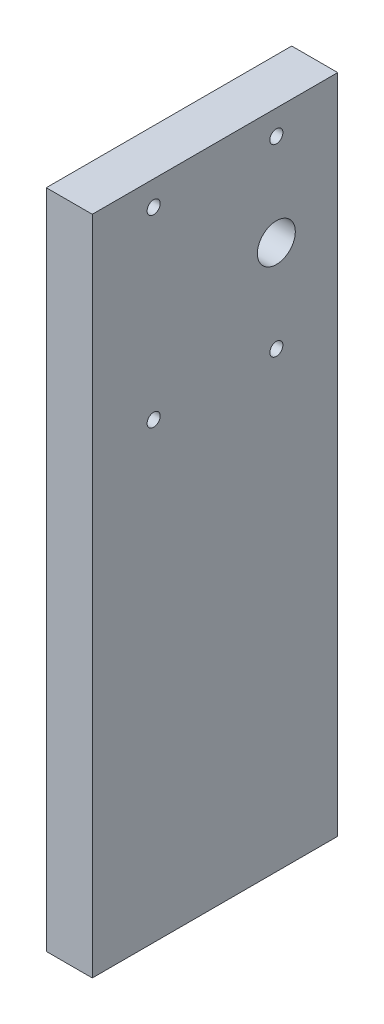
ISO-10303-21;
HEADER;
FILE_DESCRIPTION(('STEP AP214'),'2;1');
FILE_NAME('part.step','',(''),(''),'','','');
FILE_SCHEMA(('AUTOMOTIVE_DESIGN { 1 0 10303 214 1 1 1 1 }'));
ENDSEC;
DATA;
#1=APPLICATION_CONTEXT('core data for automotive mechanical design processes');
#2=APPLICATION_PROTOCOL_DEFINITION('international standard','automotive_design',2000,#1);
#3=PRODUCT_CONTEXT('',#1,'mechanical');
#4=PRODUCT('Part','Part','',(#3));
#5=PRODUCT_RELATED_PRODUCT_CATEGORY('part','',(#4));
#6=PRODUCT_DEFINITION_FORMATION('','',#4);
#7=PRODUCT_DEFINITION_CONTEXT('part definition',#1,'design');
#8=PRODUCT_DEFINITION('design','',#6,#7);
#9=PRODUCT_DEFINITION_SHAPE('','',#8);
#10=(LENGTH_UNIT() NAMED_UNIT(*) SI_UNIT(.MILLI.,.METRE.));
#11=(NAMED_UNIT(*) PLANE_ANGLE_UNIT() SI_UNIT($,.RADIAN.));
#12=(NAMED_UNIT(*) SI_UNIT($,.STERADIAN.) SOLID_ANGLE_UNIT());
#13=UNCERTAINTY_MEASURE_WITH_UNIT(LENGTH_MEASURE(1.E-05),#10,'distance_accuracy_value','');
#14=(GEOMETRIC_REPRESENTATION_CONTEXT(3) GLOBAL_UNCERTAINTY_ASSIGNED_CONTEXT((#13)) GLOBAL_UNIT_ASSIGNED_CONTEXT((#10,
#11,#12)) REPRESENTATION_CONTEXT('',''));
#15=CARTESIAN_POINT('',(0.,0.,0.));
#16=DIRECTION('',(0.,0.,1.));
#17=DIRECTION('',(1.,0.,0.));
#18=AXIS2_PLACEMENT_3D('',#15,#16,#17);
#19=CARTESIAN_POINT('',(4.7625,0.,0.));
#20=DIRECTION('',(1.,0.,0.));
#21=DIRECTION('',(0.,0.,-1.));
#22=AXIS2_PLACEMENT_3D('',#19,#20,#21);
#23=PLANE('',#22);
#24=CARTESIAN_POINT('',(4.7625,-96.774,25.4));
#25=DIRECTION('',(1.,0.,0.));
#26=DIRECTION('',(0.,0.,-1.));
#27=AXIS2_PLACEMENT_3D('',#24,#25,#26);
#28=CIRCLE('',#27,1.35254999999999);
#29=CARTESIAN_POINT('',(4.7625,-96.774,24.04745));
#30=VERTEX_POINT('',#29);
#31=EDGE_CURVE('E138',#30,#30,#28,.T.);
#32=ORIENTED_EDGE('',*,*,#31,.F.);
#33=EDGE_LOOP('',(#32));
#34=FACE_BOUND('',#33,.T.);
#35=CARTESIAN_POINT('',(4.7625,-96.774,0.));
#36=DIRECTION('',(1.,0.,0.));
#37=DIRECTION('',(0.,0.,-1.));
#38=AXIS2_PLACEMENT_3D('',#35,#36,#37);
#39=CIRCLE('',#38,1.35254999999998);
#40=CARTESIAN_POINT('',(4.7625,-96.774,-1.35254999999997));
#41=VERTEX_POINT('',#40);
#42=EDGE_CURVE('E132',#41,#41,#39,.T.);
#43=ORIENTED_EDGE('',*,*,#42,.F.);
#44=EDGE_LOOP('',(#43));
#45=FACE_BOUND('',#44,.T.);
#46=CARTESIAN_POINT('',(4.7625,-134.874,0.));
#47=DIRECTION('',(1.,0.,0.));
#48=DIRECTION('',(0.,0.,-1.));
#49=AXIS2_PLACEMENT_3D('',#46,#47,#48);
#50=CIRCLE('',#49,1.35254999999998);
#51=CARTESIAN_POINT('',(4.7625,-134.874,-1.35254999999998));
#52=VERTEX_POINT('',#51);
#53=EDGE_CURVE('E126',#52,#52,#50,.T.);
#54=ORIENTED_EDGE('',*,*,#53,.F.);
#55=EDGE_LOOP('',(#54));
#56=FACE_BOUND('',#55,.T.);
#57=CARTESIAN_POINT('',(4.7625,-134.874,25.4));
#58=DIRECTION('',(1.,0.,0.));
#59=DIRECTION('',(0.,0.,-1.));
#60=AXIS2_PLACEMENT_3D('',#57,#58,#59);
#61=CIRCLE('',#60,1.35254999999998);
#62=CARTESIAN_POINT('',(4.7625,-134.874,24.04745));
#63=VERTEX_POINT('',#62);
#64=EDGE_CURVE('E120',#63,#63,#61,.T.);
#65=ORIENTED_EDGE('',*,*,#64,.F.);
#66=EDGE_LOOP('',(#65));
#67=FACE_BOUND('',#66,.T.);
#68=DIRECTION('',(0.,-1.,0.));
#69=VECTOR('',#68,1.);
#70=CARTESIAN_POINT('',(4.7625,-91.694,38.1));
#71=LINE('',#70,#69);
#72=CARTESIAN_POINT('',(4.7625,-91.694,38.1));
#73=VERTEX_POINT('',#72);
#74=CARTESIAN_POINT('',(4.7625,-228.6,38.1));
#75=VERTEX_POINT('',#74);
#76=EDGE_CURVE('E85',#73,#75,#71,.T.);
#77=ORIENTED_EDGE('',*,*,#76,.T.);
#78=DIRECTION('',(0.,0.,-1.));
#79=VECTOR('',#78,1.);
#80=CARTESIAN_POINT('',(4.7625,-228.6,38.1));
#81=LINE('',#80,#79);
#82=CARTESIAN_POINT('',(4.7625,-228.6,-12.7));
#83=VERTEX_POINT('',#82);
#84=EDGE_CURVE('E80',#75,#83,#81,.T.);
#85=ORIENTED_EDGE('',*,*,#84,.T.);
#86=DIRECTION('',(0.,1.,0.));
#87=VECTOR('',#86,1.);
#88=CARTESIAN_POINT('',(4.7625,-91.694,-12.7));
#89=LINE('',#88,#87);
#90=CARTESIAN_POINT('',(4.7625,-91.694,-12.7));
#91=VERTEX_POINT('',#90);
#92=EDGE_CURVE('E83',#83,#91,#89,.T.);
#93=ORIENTED_EDGE('',*,*,#92,.T.);
#94=DIRECTION('',(0.,0.,1.));
#95=VECTOR('',#94,1.);
#96=CARTESIAN_POINT('',(4.7625,-91.694,38.1));
#97=LINE('',#96,#95);
#98=EDGE_CURVE('E50',#91,#73,#97,.T.);
#99=ORIENTED_EDGE('',*,*,#98,.T.);
#100=EDGE_LOOP('',(#77,#85,#93,#99));
#101=FACE_BOUND('',#100,.T.);
#102=CARTESIAN_POINT('',(4.7625,-115.824,0.));
#103=DIRECTION('',(1.,0.,0.));
#104=DIRECTION('',(0.,0.,-1.));
#105=AXIS2_PLACEMENT_3D('',#102,#103,#104);
#106=CIRCLE('',#105,3.925);
#107=CARTESIAN_POINT('',(4.7625,-115.824,-3.925));
#108=VERTEX_POINT('',#107);
#109=EDGE_CURVE('E100',#108,#108,#106,.T.);
#110=ORIENTED_EDGE('',*,*,#109,.F.);
#111=EDGE_LOOP('',(#110));
#112=FACE_BOUND('',#111,.T.);
#113=ADVANCED_FACE('F33',(#34,#45,#56,#67,#101,#112),#23,.T.);
#114=CARTESIAN_POINT('',(-4.7625,0.,0.));
#115=DIRECTION('',(1.,0.,0.));
#116=DIRECTION('',(0.,0.,-1.));
#117=AXIS2_PLACEMENT_3D('',#114,#115,#116);
#118=PLANE('',#117);
#119=CARTESIAN_POINT('',(-4.7625,-96.774,25.4));
#120=DIRECTION('',(1.,0.,0.));
#121=DIRECTION('',(0.,0.,-1.));
#122=AXIS2_PLACEMENT_3D('',#119,#120,#121);
#123=CIRCLE('',#122,1.35254999999999);
#124=CARTESIAN_POINT('',(-4.7625,-96.774,24.04745));
#125=VERTEX_POINT('',#124);
#126=EDGE_CURVE('E135',#125,#125,#123,.T.);
#127=ORIENTED_EDGE('',*,*,#126,.T.);
#128=EDGE_LOOP('',(#127));
#129=FACE_BOUND('',#128,.T.);
#130=CARTESIAN_POINT('',(-4.7625,-96.774,0.));
#131=DIRECTION('',(1.,0.,0.));
#132=DIRECTION('',(0.,0.,-1.));
#133=AXIS2_PLACEMENT_3D('',#130,#131,#132);
#134=CIRCLE('',#133,1.35254999999999);
#135=CARTESIAN_POINT('',(-4.7625,-96.774,-1.35254999999999));
#136=VERTEX_POINT('',#135);
#137=EDGE_CURVE('E129',#136,#136,#134,.T.);
#138=ORIENTED_EDGE('',*,*,#137,.T.);
#139=EDGE_LOOP('',(#138));
#140=FACE_BOUND('',#139,.T.);
#141=CARTESIAN_POINT('',(-4.7625,-134.874,0.));
#142=DIRECTION('',(1.,0.,0.));
#143=DIRECTION('',(0.,0.,-1.));
#144=AXIS2_PLACEMENT_3D('',#141,#142,#143);
#145=CIRCLE('',#144,1.35255000000001);
#146=CARTESIAN_POINT('',(-4.7625,-134.874,-1.35255000000001));
#147=VERTEX_POINT('',#146);
#148=EDGE_CURVE('E123',#147,#147,#145,.T.);
#149=ORIENTED_EDGE('',*,*,#148,.T.);
#150=EDGE_LOOP('',(#149));
#151=FACE_BOUND('',#150,.T.);
#152=CARTESIAN_POINT('',(-4.7625,-134.874,25.4));
#153=DIRECTION('',(1.,0.,0.));
#154=DIRECTION('',(0.,0.,-1.));
#155=AXIS2_PLACEMENT_3D('',#152,#153,#154);
#156=CIRCLE('',#155,1.35255000000001);
#157=CARTESIAN_POINT('',(-4.7625,-134.874,24.04745));
#158=VERTEX_POINT('',#157);
#159=EDGE_CURVE('E115',#158,#158,#156,.T.);
#160=ORIENTED_EDGE('',*,*,#159,.T.);
#161=EDGE_LOOP('',(#160));
#162=FACE_BOUND('',#161,.T.);
#163=DIRECTION('',(0.,-1.,0.));
#164=VECTOR('',#163,1.);
#165=CARTESIAN_POINT('',(-4.7625,-91.694,38.1));
#166=LINE('',#165,#164);
#167=CARTESIAN_POINT('',(-4.7625,-91.694,38.1));
#168=VERTEX_POINT('',#167);
#169=CARTESIAN_POINT('',(-4.7625,-228.6,38.1));
#170=VERTEX_POINT('',#169);
#171=EDGE_CURVE('E97',#168,#170,#166,.T.);
#172=ORIENTED_EDGE('',*,*,#171,.F.);
#173=DIRECTION('',(0.,0.,1.));
#174=VECTOR('',#173,1.);
#175=CARTESIAN_POINT('',(-4.7625,-91.694,38.1));
#176=LINE('',#175,#174);
#177=CARTESIAN_POINT('',(-4.7625,-91.694,-12.7));
#178=VERTEX_POINT('',#177);
#179=EDGE_CURVE('E73',#178,#168,#176,.T.);
#180=ORIENTED_EDGE('',*,*,#179,.F.);
#181=DIRECTION('',(0.,1.,0.));
#182=VECTOR('',#181,1.);
#183=CARTESIAN_POINT('',(-4.7625,-91.694,-12.7));
#184=LINE('',#183,#182);
#185=CARTESIAN_POINT('',(-4.7625,-228.6,-12.7));
#186=VERTEX_POINT('',#185);
#187=EDGE_CURVE('E67',#186,#178,#184,.T.);
#188=ORIENTED_EDGE('',*,*,#187,.F.);
#189=DIRECTION('',(0.,0.,-1.));
#190=VECTOR('',#189,1.);
#191=CARTESIAN_POINT('',(-4.7625,-228.6,38.1));
#192=LINE('',#191,#190);
#193=EDGE_CURVE('E89',#170,#186,#192,.T.);
#194=ORIENTED_EDGE('',*,*,#193,.F.);
#195=EDGE_LOOP('',(#172,#180,#188,#194));
#196=FACE_BOUND('',#195,.T.);
#197=CARTESIAN_POINT('',(-4.7625,-115.824,0.));
#198=DIRECTION('',(1.,0.,0.));
#199=DIRECTION('',(0.,0.,-1.));
#200=AXIS2_PLACEMENT_3D('',#197,#198,#199);
#201=CIRCLE('',#200,3.925);
#202=CARTESIAN_POINT('',(-4.7625,-115.824,-3.925));
#203=VERTEX_POINT('',#202);
#204=EDGE_CURVE('E112',#203,#203,#201,.T.);
#205=ORIENTED_EDGE('',*,*,#204,.T.);
#206=EDGE_LOOP('',(#205));
#207=FACE_BOUND('',#206,.T.);
#208=ADVANCED_FACE('F108',(#129,#140,#151,#162,#196,#207),#118,.F.);
#209=CARTESIAN_POINT('',(4.7625,-91.694,38.1));
#210=DIRECTION('',(0.,0.,-1.));
#211=DIRECTION('',(0.,1.,0.));
#212=AXIS2_PLACEMENT_3D('',#209,#210,#211);
#213=PLANE('',#212);
#214=ORIENTED_EDGE('',*,*,#171,.T.);
#215=DIRECTION('',(-1.,0.,0.));
#216=VECTOR('',#215,1.);
#217=CARTESIAN_POINT('',(4.7625,-228.6,38.1));
#218=LINE('',#217,#216);
#219=EDGE_CURVE('E11',#75,#170,#218,.T.);
#220=ORIENTED_EDGE('',*,*,#219,.F.);
#221=ORIENTED_EDGE('',*,*,#76,.F.);
#222=DIRECTION('',(-1.,0.,0.));
#223=VECTOR('',#222,1.);
#224=CARTESIAN_POINT('',(4.7625,-91.694,38.1));
#225=LINE('',#224,#223);
#226=EDGE_CURVE('E93',#73,#168,#225,.T.);
#227=ORIENTED_EDGE('',*,*,#226,.T.);
#228=EDGE_LOOP('',(#214,#220,#221,#227));
#229=FACE_BOUND('',#228,.T.);
#230=ADVANCED_FACE('F35',(#229),#213,.F.);
#231=CARTESIAN_POINT('',(4.7625,-228.6,38.1));
#232=DIRECTION('',(0.,1.,0.));
#233=DIRECTION('',(0.,0.,1.));
#234=AXIS2_PLACEMENT_3D('',#231,#232,#233);
#235=PLANE('',#234);
#236=ORIENTED_EDGE('',*,*,#193,.T.);
#237=DIRECTION('',(-1.,0.,0.));
#238=VECTOR('',#237,1.);
#239=CARTESIAN_POINT('',(4.7625,-228.6,-12.7));
#240=LINE('',#239,#238);
#241=EDGE_CURVE('E42',#83,#186,#240,.T.);
#242=ORIENTED_EDGE('',*,*,#241,.F.);
#243=ORIENTED_EDGE('',*,*,#84,.F.);
#244=ORIENTED_EDGE('',*,*,#219,.T.);
#245=EDGE_LOOP('',(#236,#242,#243,#244));
#246=FACE_BOUND('',#245,.T.);
#247=ADVANCED_FACE('F88',(#246),#235,.F.);
#248=CARTESIAN_POINT('',(4.7625,-91.694,-12.7));
#249=DIRECTION('',(0.,0.,1.));
#250=DIRECTION('',(0.,-1.,0.));
#251=AXIS2_PLACEMENT_3D('',#248,#249,#250);
#252=PLANE('',#251);
#253=ORIENTED_EDGE('',*,*,#187,.T.);
#254=DIRECTION('',(-1.,0.,0.));
#255=VECTOR('',#254,1.);
#256=CARTESIAN_POINT('',(4.7625,-91.694,-12.7));
#257=LINE('',#256,#255);
#258=EDGE_CURVE('E90',#91,#178,#257,.T.);
#259=ORIENTED_EDGE('',*,*,#258,.F.);
#260=ORIENTED_EDGE('',*,*,#92,.F.);
#261=ORIENTED_EDGE('',*,*,#241,.T.);
#262=EDGE_LOOP('',(#253,#259,#260,#261));
#263=FACE_BOUND('',#262,.T.);
#264=ADVANCED_FACE('F91',(#263),#252,.F.);
#265=CARTESIAN_POINT('',(4.7625,-91.694,38.1));
#266=DIRECTION('',(0.,-1.,0.));
#267=DIRECTION('',(0.,0.,-1.));
#268=AXIS2_PLACEMENT_3D('',#265,#266,#267);
#269=PLANE('',#268);
#270=ORIENTED_EDGE('',*,*,#179,.T.);
#271=ORIENTED_EDGE('',*,*,#226,.F.);
#272=ORIENTED_EDGE('',*,*,#98,.F.);
#273=ORIENTED_EDGE('',*,*,#258,.T.);
#274=EDGE_LOOP('',(#270,#271,#272,#273));
#275=FACE_BOUND('',#274,.T.);
#276=ADVANCED_FACE('F105',(#275),#269,.F.);
#277=CARTESIAN_POINT('',(4.7625,-115.824,0.));
#278=DIRECTION('',(-1.,0.,0.));
#279=DIRECTION('',(0.,0.,1.));
#280=AXIS2_PLACEMENT_3D('',#277,#278,#279);
#281=CYLINDRICAL_SURFACE('',#280,3.925);
#282=ORIENTED_EDGE('',*,*,#109,.T.);
#283=EDGE_LOOP('',(#282));
#284=FACE_BOUND('',#283,.T.);
#285=ORIENTED_EDGE('',*,*,#204,.F.);
#286=EDGE_LOOP('',(#285));
#287=FACE_BOUND('',#286,.T.);
#288=ADVANCED_FACE('F156',(#284,#287),#281,.F.);
#289=CARTESIAN_POINT('',(4.7625,-134.874,25.4));
#290=DIRECTION('',(1.,0.,0.));
#291=DIRECTION('',(0.,0.,-1.));
#292=AXIS2_PLACEMENT_3D('',#289,#290,#291);
#293=CYLINDRICAL_SURFACE('',#292,1.35254999999999);
#294=ORIENTED_EDGE('',*,*,#159,.F.);
#295=EDGE_LOOP('',(#294));
#296=FACE_BOUND('',#295,.T.);
#297=ORIENTED_EDGE('',*,*,#64,.T.);
#298=EDGE_LOOP('',(#297));
#299=FACE_BOUND('',#298,.T.);
#300=ADVANCED_FACE('F153',(#296,#299),#293,.F.);
#301=CARTESIAN_POINT('',(4.7625,-134.874,0.));
#302=DIRECTION('',(1.,0.,0.));
#303=DIRECTION('',(0.,0.,-1.));
#304=AXIS2_PLACEMENT_3D('',#301,#302,#303);
#305=CYLINDRICAL_SURFACE('',#304,1.35254999999999);
#306=ORIENTED_EDGE('',*,*,#148,.F.);
#307=EDGE_LOOP('',(#306));
#308=FACE_BOUND('',#307,.T.);
#309=ORIENTED_EDGE('',*,*,#53,.T.);
#310=EDGE_LOOP('',(#309));
#311=FACE_BOUND('',#310,.T.);
#312=ADVANCED_FACE('F155',(#308,#311),#305,.F.);
#313=CARTESIAN_POINT('',(4.7625,-96.774,0.));
#314=DIRECTION('',(1.,0.,0.));
#315=DIRECTION('',(0.,0.,-1.));
#316=AXIS2_PLACEMENT_3D('',#313,#314,#315);
#317=CYLINDRICAL_SURFACE('',#316,1.35254999999999);
#318=ORIENTED_EDGE('',*,*,#137,.F.);
#319=EDGE_LOOP('',(#318));
#320=FACE_BOUND('',#319,.T.);
#321=ORIENTED_EDGE('',*,*,#42,.T.);
#322=EDGE_LOOP('',(#321));
#323=FACE_BOUND('',#322,.T.);
#324=ADVANCED_FACE('F163',(#320,#323),#317,.F.);
#325=CARTESIAN_POINT('',(4.7625,-96.774,25.4));
#326=DIRECTION('',(1.,0.,0.));
#327=DIRECTION('',(0.,0.,-1.));
#328=AXIS2_PLACEMENT_3D('',#325,#326,#327);
#329=CYLINDRICAL_SURFACE('',#328,1.35254999999999);
#330=ORIENTED_EDGE('',*,*,#126,.F.);
#331=EDGE_LOOP('',(#330));
#332=FACE_BOUND('',#331,.T.);
#333=ORIENTED_EDGE('',*,*,#31,.T.);
#334=EDGE_LOOP('',(#333));
#335=FACE_BOUND('',#334,.T.);
#336=ADVANCED_FACE('F142',(#332,#335),#329,.F.);
#337=CLOSED_SHELL('',(#113,#208,#230,#247,#264,#276,#288,#300,#312,#324,#336));
#338=MANIFOLD_SOLID_BREP('B2',#337);
#339=ADVANCED_BREP_SHAPE_REPRESENTATION('',(#18,#338),#14);
#340=SHAPE_DEFINITION_REPRESENTATION(#9,#339);
ENDSEC;
END-ISO-10303-21;
